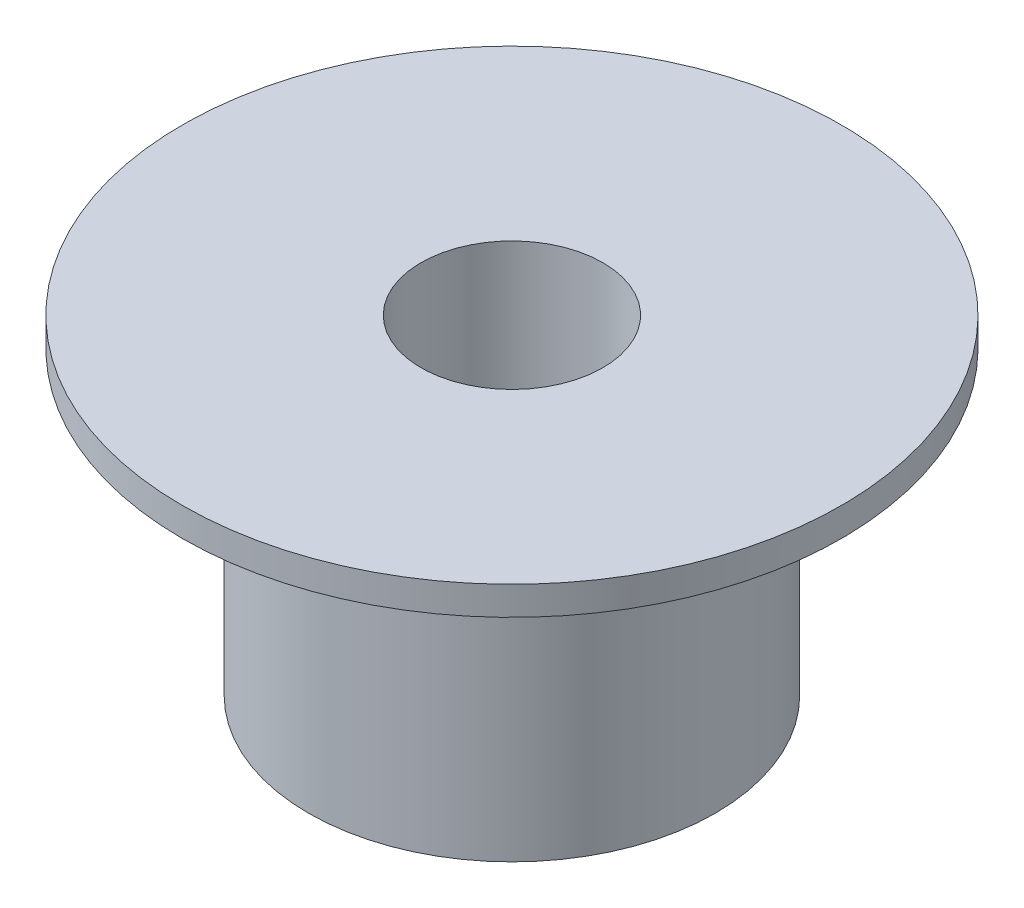
ISO-10303-21;
HEADER;
FILE_DESCRIPTION(('STEP AP214'),'2;1');
FILE_NAME('part.step','',(''),(''),'','','');
FILE_SCHEMA(('AUTOMOTIVE_DESIGN { 1 0 10303 214 1 1 1 1 }'));
ENDSEC;
DATA;
#1=APPLICATION_CONTEXT('core data for automotive mechanical design processes');
#2=APPLICATION_PROTOCOL_DEFINITION('international standard','automotive_design',2000,#1);
#3=PRODUCT_CONTEXT('',#1,'mechanical');
#4=PRODUCT('Part','Part','',(#3));
#5=PRODUCT_RELATED_PRODUCT_CATEGORY('part','',(#4));
#6=PRODUCT_DEFINITION_FORMATION('','',#4);
#7=PRODUCT_DEFINITION_CONTEXT('part definition',#1,'design');
#8=PRODUCT_DEFINITION('design','',#6,#7);
#9=PRODUCT_DEFINITION_SHAPE('','',#8);
#10=(LENGTH_UNIT() NAMED_UNIT(*) SI_UNIT(.MILLI.,.METRE.));
#11=(NAMED_UNIT(*) PLANE_ANGLE_UNIT() SI_UNIT($,.RADIAN.));
#12=(NAMED_UNIT(*) SI_UNIT($,.STERADIAN.) SOLID_ANGLE_UNIT());
#13=UNCERTAINTY_MEASURE_WITH_UNIT(LENGTH_MEASURE(1.E-05),#10,'distance_accuracy_value','');
#14=(GEOMETRIC_REPRESENTATION_CONTEXT(3) GLOBAL_UNCERTAINTY_ASSIGNED_CONTEXT((#13)) GLOBAL_UNIT_ASSIGNED_CONTEXT((#10,
#11,#12)) REPRESENTATION_CONTEXT('',''));
#15=CARTESIAN_POINT('',(0.,0.,0.));
#16=DIRECTION('',(0.,0.,1.));
#17=DIRECTION('',(1.,0.,0.));
#18=AXIS2_PLACEMENT_3D('',#15,#16,#17);
#19=CARTESIAN_POINT('',(0.,10.5,0.));
#20=DIRECTION('',(0.,-1.,0.));
#21=DIRECTION('',(0.,0.,-1.));
#22=AXIS2_PLACEMENT_3D('',#19,#20,#21);
#23=CYLINDRICAL_SURFACE('',#22,7.1);
#24=CARTESIAN_POINT('',(0.,10.5,0.));
#25=DIRECTION('',(0.,1.,0.));
#26=DIRECTION('',(0.,0.,1.));
#27=AXIS2_PLACEMENT_3D('',#24,#25,#26);
#28=CIRCLE('',#27,7.1);
#29=CARTESIAN_POINT('',(0.,10.5,7.1));
#30=VERTEX_POINT('',#29);
#31=EDGE_CURVE('E10',#30,#30,#28,.T.);
#32=ORIENTED_EDGE('',*,*,#31,.F.);
#33=EDGE_LOOP('',(#32));
#34=FACE_BOUND('',#33,.T.);
#35=CARTESIAN_POINT('',(0.,0.,0.));
#36=DIRECTION('',(0.,1.,0.));
#37=DIRECTION('',(0.,0.,1.));
#38=AXIS2_PLACEMENT_3D('',#35,#36,#37);
#39=CIRCLE('',#38,7.1);
#40=CARTESIAN_POINT('',(0.,0.,7.1));
#41=VERTEX_POINT('',#40);
#42=EDGE_CURVE('E34',#41,#41,#39,.T.);
#43=ORIENTED_EDGE('',*,*,#42,.T.);
#44=EDGE_LOOP('',(#43));
#45=FACE_BOUND('',#44,.T.);
#46=ADVANCED_FACE('F31',(#34,#45),#23,.T.);
#47=CARTESIAN_POINT('',(0.,0.,0.));
#48=DIRECTION('',(0.,1.,0.));
#49=DIRECTION('',(0.,0.,1.));
#50=AXIS2_PLACEMENT_3D('',#47,#48,#49);
#51=PLANE('',#50);
#52=CARTESIAN_POINT('',(0.,0.,0.));
#53=DIRECTION('',(0.,-1.,0.));
#54=DIRECTION('',(0.,0.,-1.));
#55=AXIS2_PLACEMENT_3D('',#52,#53,#54);
#56=CIRCLE('',#55,3.175);
#57=CARTESIAN_POINT('',(0.,0.,-3.175));
#58=VERTEX_POINT('',#57);
#59=EDGE_CURVE('E49',#58,#58,#56,.T.);
#60=ORIENTED_EDGE('',*,*,#59,.F.);
#61=EDGE_LOOP('',(#60));
#62=FACE_BOUND('',#61,.T.);
#63=ORIENTED_EDGE('',*,*,#42,.F.);
#64=EDGE_LOOP('',(#63));
#65=FACE_BOUND('',#64,.T.);
#66=ADVANCED_FACE('F64',(#62,#65),#51,.F.);
#67=CARTESIAN_POINT('',(0.,10.5,0.));
#68=DIRECTION('',(0.,1.,0.));
#69=DIRECTION('',(0.,0.,1.));
#70=AXIS2_PLACEMENT_3D('',#67,#68,#69);
#71=PLANE('',#70);
#72=CARTESIAN_POINT('',(0.,10.5,0.));
#73=DIRECTION('',(0.,1.,0.));
#74=DIRECTION('',(0.,0.,1.));
#75=AXIS2_PLACEMENT_3D('',#72,#73,#74);
#76=CIRCLE('',#75,11.5);
#77=CARTESIAN_POINT('',(0.,10.5,11.5));
#78=VERTEX_POINT('',#77);
#79=EDGE_CURVE('E43',#78,#78,#76,.T.);
#80=ORIENTED_EDGE('',*,*,#79,.F.);
#81=EDGE_LOOP('',(#80));
#82=FACE_BOUND('',#81,.T.);
#83=ORIENTED_EDGE('',*,*,#31,.T.);
#84=EDGE_LOOP('',(#83));
#85=FACE_BOUND('',#84,.T.);
#86=ADVANCED_FACE('F67',(#82,#85),#71,.F.);
#87=CARTESIAN_POINT('',(0.,11.5,0.));
#88=DIRECTION('',(0.,-1.,0.));
#89=DIRECTION('',(0.,0.,-1.));
#90=AXIS2_PLACEMENT_3D('',#87,#88,#89);
#91=CYLINDRICAL_SURFACE('',#90,11.5);
#92=CARTESIAN_POINT('',(0.,11.5,0.));
#93=DIRECTION('',(0.,1.,0.));
#94=DIRECTION('',(0.,0.,1.));
#95=AXIS2_PLACEMENT_3D('',#92,#93,#94);
#96=CIRCLE('',#95,11.5);
#97=CARTESIAN_POINT('',(0.,11.5,11.5));
#98=VERTEX_POINT('',#97);
#99=EDGE_CURVE('E41',#98,#98,#96,.T.);
#100=ORIENTED_EDGE('',*,*,#99,.F.);
#101=EDGE_LOOP('',(#100));
#102=FACE_BOUND('',#101,.T.);
#103=ORIENTED_EDGE('',*,*,#79,.T.);
#104=EDGE_LOOP('',(#103));
#105=FACE_BOUND('',#104,.T.);
#106=ADVANCED_FACE('F86',(#102,#105),#91,.T.);
#107=CARTESIAN_POINT('',(0.,11.5,0.));
#108=DIRECTION('',(0.,1.,0.));
#109=DIRECTION('',(0.,0.,1.));
#110=AXIS2_PLACEMENT_3D('',#107,#108,#109);
#111=PLANE('',#110);
#112=CARTESIAN_POINT('',(0.,11.5,0.));
#113=DIRECTION('',(0.,-1.,0.));
#114=DIRECTION('',(0.,0.,-1.));
#115=AXIS2_PLACEMENT_3D('',#112,#113,#114);
#116=CIRCLE('',#115,3.175);
#117=CARTESIAN_POINT('',(0.,11.5,-3.175));
#118=VERTEX_POINT('',#117);
#119=EDGE_CURVE('E46',#118,#118,#116,.T.);
#120=ORIENTED_EDGE('',*,*,#119,.T.);
#121=EDGE_LOOP('',(#120));
#122=FACE_BOUND('',#121,.T.);
#123=ORIENTED_EDGE('',*,*,#99,.T.);
#124=EDGE_LOOP('',(#123));
#125=FACE_BOUND('',#124,.T.);
#126=ADVANCED_FACE('F55',(#122,#125),#111,.T.);
#127=CARTESIAN_POINT('',(0.,11.5,0.));
#128=DIRECTION('',(0.,-1.,0.));
#129=DIRECTION('',(0.,0.,-1.));
#130=AXIS2_PLACEMENT_3D('',#127,#128,#129);
#131=CYLINDRICAL_SURFACE('',#130,3.175);
#132=ORIENTED_EDGE('',*,*,#119,.F.);
#133=EDGE_LOOP('',(#132));
#134=FACE_BOUND('',#133,.T.);
#135=ORIENTED_EDGE('',*,*,#59,.T.);
#136=EDGE_LOOP('',(#135));
#137=FACE_BOUND('',#136,.T.);
#138=ADVANCED_FACE('F58',(#134,#137),#131,.F.);
#139=CLOSED_SHELL('',(#46,#66,#86,#106,#126,#138));
#140=MANIFOLD_SOLID_BREP('B2',#139);
#141=ADVANCED_BREP_SHAPE_REPRESENTATION('',(#18,#140),#14);
#142=SHAPE_DEFINITION_REPRESENTATION(#9,#141);
ENDSEC;
END-ISO-10303-21;
